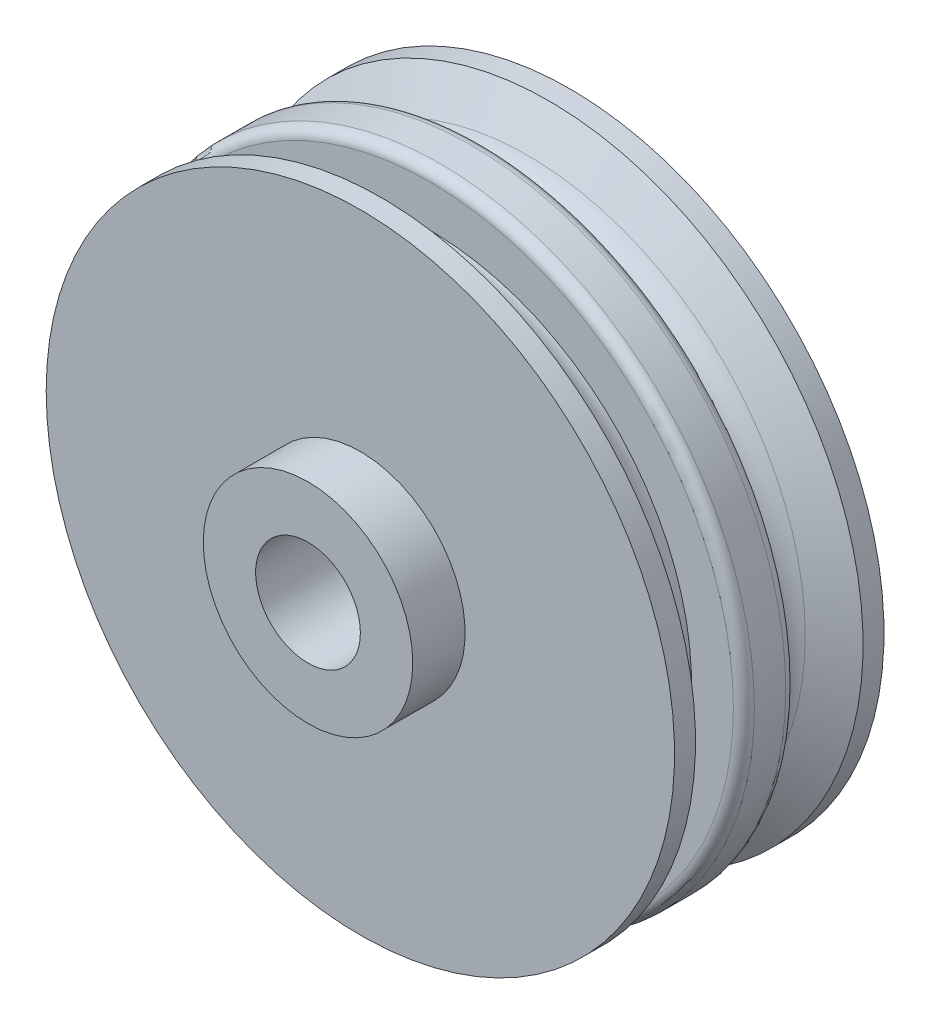
ISO-10303-21;
HEADER;
FILE_DESCRIPTION(('STEP AP214'),'2;1');
FILE_NAME('part.step','',(''),(''),'','','');
FILE_SCHEMA(('AUTOMOTIVE_DESIGN { 1 0 10303 214 1 1 1 1 }'));
ENDSEC;
DATA;
#1=APPLICATION_CONTEXT('core data for automotive mechanical design processes');
#2=APPLICATION_PROTOCOL_DEFINITION('international standard','automotive_design',2000,#1);
#3=PRODUCT_CONTEXT('',#1,'mechanical');
#4=PRODUCT('Part','Part','',(#3));
#5=PRODUCT_RELATED_PRODUCT_CATEGORY('part','',(#4));
#6=PRODUCT_DEFINITION_FORMATION('','',#4);
#7=PRODUCT_DEFINITION_CONTEXT('part definition',#1,'design');
#8=PRODUCT_DEFINITION('design','',#6,#7);
#9=PRODUCT_DEFINITION_SHAPE('','',#8);
#10=(LENGTH_UNIT() NAMED_UNIT(*) SI_UNIT(.MILLI.,.METRE.));
#11=(NAMED_UNIT(*) PLANE_ANGLE_UNIT() SI_UNIT($,.RADIAN.));
#12=(NAMED_UNIT(*) SI_UNIT($,.STERADIAN.) SOLID_ANGLE_UNIT());
#13=UNCERTAINTY_MEASURE_WITH_UNIT(LENGTH_MEASURE(1.E-05),#10,'distance_accuracy_value','');
#14=(GEOMETRIC_REPRESENTATION_CONTEXT(3) GLOBAL_UNCERTAINTY_ASSIGNED_CONTEXT((#13)) GLOBAL_UNIT_ASSIGNED_CONTEXT((#10,
#11,#12)) REPRESENTATION_CONTEXT('',''));
#15=CARTESIAN_POINT('',(0.,0.,0.));
#16=DIRECTION('',(0.,0.,1.));
#17=DIRECTION('',(1.,0.,0.));
#18=AXIS2_PLACEMENT_3D('',#15,#16,#17);
#19=CARTESIAN_POINT('',(0.,0.,0.));
#20=DIRECTION('',(0.,0.,-1.));
#21=DIRECTION('',(-1.,0.,0.));
#22=AXIS2_PLACEMENT_3D('',#19,#20,#21);
#23=CYLINDRICAL_SURFACE('',#22,25.);
#24=CARTESIAN_POINT('',(0.,0.,11.618802153517));
#25=DIRECTION('',(0.,0.,-1.));
#26=DIRECTION('',(-1.,0.,0.));
#27=AXIS2_PLACEMENT_3D('',#24,#25,#26);
#28=CIRCLE('',#27,25.);
#29=CARTESIAN_POINT('',(-25.,0.,11.618802153517));
#30=VERTEX_POINT('',#29);
#31=EDGE_CURVE('E81',#30,#30,#28,.F.);
#32=ORIENTED_EDGE('',*,*,#31,.T.);
#33=EDGE_LOOP('',(#32));
#34=FACE_BOUND('',#33,.T.);
#35=CARTESIAN_POINT('',(0.,0.,13.381197846483));
#36=DIRECTION('',(0.,0.,1.));
#37=DIRECTION('',(1.,0.,0.));
#38=AXIS2_PLACEMENT_3D('',#35,#36,#37);
#39=CIRCLE('',#38,25.);
#40=CARTESIAN_POINT('',(25.,0.,13.381197846483));
#41=VERTEX_POINT('',#40);
#42=EDGE_CURVE('E125',#41,#41,#39,.T.);
#43=ORIENTED_EDGE('',*,*,#42,.F.);
#44=EDGE_LOOP('',(#43));
#45=FACE_BOUND('',#44,.T.);
#46=ADVANCED_FACE('F45',(#34,#45),#23,.T.);
#47=CARTESIAN_POINT('',(0.,0.,30.));
#48=DIRECTION('',(0.,0.,-1.));
#49=DIRECTION('',(-1.,0.,0.));
#50=AXIS2_PLACEMENT_3D('',#47,#48,#49);
#51=CYLINDRICAL_SURFACE('',#50,10.);
#52=CARTESIAN_POINT('',(0.,0.,30.));
#53=DIRECTION('',(0.,0.,1.));
#54=DIRECTION('',(1.,0.,0.));
#55=AXIS2_PLACEMENT_3D('',#52,#53,#54);
#56=CIRCLE('',#55,10.);
#57=CARTESIAN_POINT('',(10.,0.,30.));
#58=VERTEX_POINT('',#57);
#59=EDGE_CURVE('E89',#58,#58,#56,.T.);
#60=ORIENTED_EDGE('',*,*,#59,.F.);
#61=EDGE_LOOP('',(#60));
#62=FACE_BOUND('',#61,.T.);
#63=CARTESIAN_POINT('',(0.,0.,25.));
#64=DIRECTION('',(0.,0.,-1.));
#65=DIRECTION('',(-1.,0.,0.));
#66=AXIS2_PLACEMENT_3D('',#63,#64,#65);
#67=CIRCLE('',#66,10.);
#68=CARTESIAN_POINT('',(-10.,0.,25.));
#69=VERTEX_POINT('',#68);
#70=EDGE_CURVE('E85',#69,#69,#67,.T.);
#71=ORIENTED_EDGE('',*,*,#70,.F.);
#72=EDGE_LOOP('',(#71));
#73=FACE_BOUND('',#72,.T.);
#74=ADVANCED_FACE('F133',(#62,#73),#51,.T.);
#75=CARTESIAN_POINT('',(0.,0.,30.));
#76=DIRECTION('',(0.,0.,1.));
#77=DIRECTION('',(1.,0.,0.));
#78=AXIS2_PLACEMENT_3D('',#75,#76,#77);
#79=PLANE('',#78);
#80=ORIENTED_EDGE('',*,*,#59,.T.);
#81=EDGE_LOOP('',(#80));
#82=FACE_BOUND('',#81,.T.);
#83=CARTESIAN_POINT('',(0.,0.,30.));
#84=DIRECTION('',(0.,0.,1.));
#85=DIRECTION('',(1.,0.,0.));
#86=AXIS2_PLACEMENT_3D('',#83,#84,#85);
#87=CIRCLE('',#86,5.);
#88=CARTESIAN_POINT('',(5.,0.,30.));
#89=VERTEX_POINT('',#88);
#90=EDGE_CURVE('E94',#89,#89,#87,.T.);
#91=ORIENTED_EDGE('',*,*,#90,.F.);
#92=EDGE_LOOP('',(#91));
#93=FACE_BOUND('',#92,.T.);
#94=ADVANCED_FACE('F139',(#82,#93),#79,.T.);
#95=CARTESIAN_POINT('',(0.,0.,0.));
#96=DIRECTION('',(0.,0.,1.));
#97=DIRECTION('',(1.,0.,0.));
#98=AXIS2_PLACEMENT_3D('',#95,#96,#97);
#99=PLANE('',#98);
#100=CARTESIAN_POINT('',(0.,0.,0.));
#101=DIRECTION('',(0.,0.,1.));
#102=DIRECTION('',(1.,0.,0.));
#103=AXIS2_PLACEMENT_3D('',#100,#101,#102);
#104=CIRCLE('',#103,10.);
#105=CARTESIAN_POINT('',(10.,0.,0.));
#106=VERTEX_POINT('',#105);
#107=EDGE_CURVE('E90',#106,#106,#104,.T.);
#108=ORIENTED_EDGE('',*,*,#107,.F.);
#109=EDGE_LOOP('',(#108));
#110=FACE_BOUND('',#109,.T.);
#111=CARTESIAN_POINT('',(0.,0.,0.));
#112=DIRECTION('',(0.,0.,1.));
#113=DIRECTION('',(1.,0.,0.));
#114=AXIS2_PLACEMENT_3D('',#111,#112,#113);
#115=CIRCLE('',#114,5.);
#116=CARTESIAN_POINT('',(5.,0.,0.));
#117=VERTEX_POINT('',#116);
#118=EDGE_CURVE('E98',#117,#117,#115,.T.);
#119=ORIENTED_EDGE('',*,*,#118,.T.);
#120=EDGE_LOOP('',(#119));
#121=FACE_BOUND('',#120,.T.);
#122=ADVANCED_FACE('F161',(#110,#121),#99,.F.);
#123=CARTESIAN_POINT('',(0.,0.,5.));
#124=DIRECTION('',(0.,0.,-1.));
#125=DIRECTION('',(-1.,0.,0.));
#126=AXIS2_PLACEMENT_3D('',#123,#124,#125);
#127=CIRCLE('',#126,10.);
#128=CARTESIAN_POINT('',(-10.,0.,5.));
#129=VERTEX_POINT('',#128);
#130=EDGE_CURVE('E117',#129,#129,#127,.T.);
#131=ORIENTED_EDGE('',*,*,#130,.T.);
#132=EDGE_LOOP('',(#131));
#133=FACE_BOUND('',#132,.T.);
#134=ORIENTED_EDGE('',*,*,#107,.T.);
#135=EDGE_LOOP('',(#134));
#136=FACE_BOUND('',#135,.T.);
#137=ADVANCED_FACE('F142',(#133,#136),#51,.T.);
#138=CARTESIAN_POINT('',(0.,0.,30.));
#139=DIRECTION('',(0.,0.,-1.));
#140=DIRECTION('',(-1.,0.,0.));
#141=AXIS2_PLACEMENT_3D('',#138,#139,#140);
#142=CYLINDRICAL_SURFACE('',#141,5.);
#143=ORIENTED_EDGE('',*,*,#90,.T.);
#144=EDGE_LOOP('',(#143));
#145=FACE_BOUND('',#144,.T.);
#146=ORIENTED_EDGE('',*,*,#118,.F.);
#147=EDGE_LOOP('',(#146));
#148=FACE_BOUND('',#147,.T.);
#149=ADVANCED_FACE('F154',(#145,#148),#142,.F.);
#150=CARTESIAN_POINT('',(0.,0.,0.));
#151=DIRECTION('',(0.,0.,-1.));
#152=DIRECTION('',(-1.,0.,0.));
#153=AXIS2_PLACEMENT_3D('',#150,#151,#152);
#154=CYLINDRICAL_SURFACE('',#153,30.);
#155=CARTESIAN_POINT('',(0.,0.,23.));
#156=DIRECTION('',(0.,0.,-1.));
#157=DIRECTION('',(-1.,0.,0.));
#158=AXIS2_PLACEMENT_3D('',#155,#156,#157);
#159=CIRCLE('',#158,30.);
#160=CARTESIAN_POINT('',(-30.,0.,23.));
#161=VERTEX_POINT('',#160);
#162=EDGE_CURVE('E102',#161,#161,#159,.T.);
#163=ORIENTED_EDGE('',*,*,#162,.F.);
#164=EDGE_LOOP('',(#163));
#165=FACE_BOUND('',#164,.T.);
#166=CARTESIAN_POINT('',(0.,0.,25.));
#167=DIRECTION('',(0.,0.,-1.));
#168=DIRECTION('',(-1.,0.,0.));
#169=AXIS2_PLACEMENT_3D('',#166,#167,#168);
#170=CIRCLE('',#169,30.);
#171=CARTESIAN_POINT('',(-30.,0.,25.));
#172=VERTEX_POINT('',#171);
#173=EDGE_CURVE('E121',#172,#172,#170,.T.);
#174=ORIENTED_EDGE('',*,*,#173,.T.);
#175=EDGE_LOOP('',(#174));
#176=FACE_BOUND('',#175,.T.);
#177=ADVANCED_FACE('F150',(#165,#176),#154,.T.);
#178=CARTESIAN_POINT('',(0.,0.,23.));
#179=DIRECTION('',(0.,0.,1.));
#180=DIRECTION('',(1.,0.,0.));
#181=AXIS2_PLACEMENT_3D('',#178,#179,#180);
#182=CONICAL_SURFACE('',#181,30.,1.0471975511966);
#183=CARTESIAN_POINT('',(0.,0.,20.9792740578363));
#184=DIRECTION('',(0.,0.,-1.));
#185=DIRECTION('',(-1.,0.,0.));
#186=AXIS2_PLACEMENT_3D('',#183,#184,#185);
#187=CIRCLE('',#186,26.5);
#188=CARTESIAN_POINT('',(-26.5,0.,20.9792740578363));
#189=VERTEX_POINT('',#188);
#190=EDGE_CURVE('E73',#189,#189,#187,.F.);
#191=ORIENTED_EDGE('',*,*,#190,.T.);
#192=EDGE_LOOP('',(#191));
#193=FACE_BOUND('',#192,.T.);
#194=ORIENTED_EDGE('',*,*,#162,.T.);
#195=EDGE_LOOP('',(#194));
#196=FACE_BOUND('',#195,.T.);
#197=ADVANCED_FACE('F147',(#193,#196),#182,.T.);
#198=CARTESIAN_POINT('',(0.,0.,7.));
#199=DIRECTION('',(0.,0.,-1.));
#200=DIRECTION('',(-1.,0.,0.));
#201=AXIS2_PLACEMENT_3D('',#198,#199,#200);
#202=CONICAL_SURFACE('',#201,30.,1.0471975511966);
#203=CARTESIAN_POINT('',(0.,0.,9.02072594216368));
#204=DIRECTION('',(0.,0.,-1.));
#205=DIRECTION('',(-1.,0.,0.));
#206=AXIS2_PLACEMENT_3D('',#203,#204,#205);
#207=CIRCLE('',#206,26.5);
#208=CARTESIAN_POINT('',(-26.5,0.,9.02072594216368));
#209=VERTEX_POINT('',#208);
#210=EDGE_CURVE('E69',#209,#209,#207,.T.);
#211=ORIENTED_EDGE('',*,*,#210,.T.);
#212=EDGE_LOOP('',(#211));
#213=FACE_BOUND('',#212,.T.);
#214=CARTESIAN_POINT('',(0.,0.,7.));
#215=DIRECTION('',(0.,0.,-1.));
#216=DIRECTION('',(-1.,0.,0.));
#217=AXIS2_PLACEMENT_3D('',#214,#215,#216);
#218=CIRCLE('',#217,30.);
#219=CARTESIAN_POINT('',(-30.,0.,7.));
#220=VERTEX_POINT('',#219);
#221=EDGE_CURVE('E109',#220,#220,#218,.T.);
#222=ORIENTED_EDGE('',*,*,#221,.F.);
#223=EDGE_LOOP('',(#222));
#224=FACE_BOUND('',#223,.T.);
#225=ADVANCED_FACE('F145',(#213,#224),#202,.T.);
#226=CARTESIAN_POINT('',(0.,0.,0.));
#227=DIRECTION('',(0.,0.,-1.));
#228=DIRECTION('',(-1.,0.,0.));
#229=AXIS2_PLACEMENT_3D('',#226,#227,#228);
#230=CYLINDRICAL_SURFACE('',#229,30.);
#231=ORIENTED_EDGE('',*,*,#221,.T.);
#232=EDGE_LOOP('',(#231));
#233=FACE_BOUND('',#232,.T.);
#234=CARTESIAN_POINT('',(0.,0.,5.));
#235=DIRECTION('',(0.,0.,-1.));
#236=DIRECTION('',(-1.,0.,0.));
#237=AXIS2_PLACEMENT_3D('',#234,#235,#236);
#238=CIRCLE('',#237,30.);
#239=CARTESIAN_POINT('',(-30.,0.,5.));
#240=VERTEX_POINT('',#239);
#241=EDGE_CURVE('E113',#240,#240,#238,.T.);
#242=ORIENTED_EDGE('',*,*,#241,.F.);
#243=EDGE_LOOP('',(#242));
#244=FACE_BOUND('',#243,.T.);
#245=ADVANCED_FACE('F205',(#233,#244),#230,.T.);
#246=CARTESIAN_POINT('',(0.,0.,5.));
#247=DIRECTION('',(0.,0.,-1.));
#248=DIRECTION('',(-1.,0.,0.));
#249=AXIS2_PLACEMENT_3D('',#246,#247,#248);
#250=PLANE('',#249);
#251=ORIENTED_EDGE('',*,*,#241,.T.);
#252=EDGE_LOOP('',(#251));
#253=FACE_BOUND('',#252,.T.);
#254=ORIENTED_EDGE('',*,*,#130,.F.);
#255=EDGE_LOOP('',(#254));
#256=FACE_BOUND('',#255,.T.);
#257=ADVANCED_FACE('F202',(#253,#256),#250,.T.);
#258=CARTESIAN_POINT('',(0.,0.,25.));
#259=DIRECTION('',(0.,0.,-1.));
#260=DIRECTION('',(-1.,0.,0.));
#261=AXIS2_PLACEMENT_3D('',#258,#259,#260);
#262=PLANE('',#261);
#263=ORIENTED_EDGE('',*,*,#173,.F.);
#264=EDGE_LOOP('',(#263));
#265=FACE_BOUND('',#264,.T.);
#266=ORIENTED_EDGE('',*,*,#70,.T.);
#267=EDGE_LOOP('',(#266));
#268=FACE_BOUND('',#267,.T.);
#269=ADVANCED_FACE('F172',(#265,#268),#262,.F.);
#270=CARTESIAN_POINT('',(0.,0.,18.381197846483));
#271=DIRECTION('',(0.,0.,-1.));
#272=DIRECTION('',(-1.,0.,0.));
#273=AXIS2_PLACEMENT_3D('',#270,#271,#272);
#274=TOROIDAL_SURFACE('',#273,28.,3.);
#275=ORIENTED_EDGE('',*,*,#190,.F.);
#276=EDGE_LOOP('',(#275));
#277=FACE_BOUND('',#276,.T.);
#278=CARTESIAN_POINT('',(0.,0.,18.381197846483));
#279=DIRECTION('',(0.,0.,-1.));
#280=DIRECTION('',(-1.,0.,0.));
#281=AXIS2_PLACEMENT_3D('',#278,#279,#280);
#282=CIRCLE('',#281,25.);
#283=CARTESIAN_POINT('',(-25.,0.,18.381197846483));
#284=VERTEX_POINT('',#283);
#285=EDGE_CURVE('E77',#284,#284,#282,.T.);
#286=ORIENTED_EDGE('',*,*,#285,.F.);
#287=EDGE_LOOP('',(#286));
#288=FACE_BOUND('',#287,.T.);
#289=ADVANCED_FACE('F168',(#277,#288),#274,.F.);
#290=CARTESIAN_POINT('',(0.,0.,11.618802153517));
#291=DIRECTION('',(0.,0.,-1.));
#292=DIRECTION('',(-1.,0.,0.));
#293=AXIS2_PLACEMENT_3D('',#290,#291,#292);
#294=TOROIDAL_SURFACE('',#293,28.,3.);
#295=ORIENTED_EDGE('',*,*,#31,.F.);
#296=EDGE_LOOP('',(#295));
#297=FACE_BOUND('',#296,.T.);
#298=ORIENTED_EDGE('',*,*,#210,.F.);
#299=EDGE_LOOP('',(#298));
#300=FACE_BOUND('',#299,.T.);
#301=ADVANCED_FACE('F171',(#297,#300),#294,.F.);
#302=CARTESIAN_POINT('',(0.,0.,13.381197846483));
#303=DIRECTION('',(0.,0.,1.));
#304=DIRECTION('',(1.,0.,0.));
#305=AXIS2_PLACEMENT_3D('',#302,#303,#304);
#306=CYLINDRICAL_SURFACE('',#305,30.);
#307=CARTESIAN_POINT('',(0.,0.,17.381197846483));
#308=DIRECTION('',(0.,0.,1.));
#309=DIRECTION('',(1.,0.,0.));
#310=AXIS2_PLACEMENT_3D('',#307,#308,#309);
#311=CIRCLE('',#310,30.);
#312=CARTESIAN_POINT('',(30.,0.,17.381197846483));
#313=VERTEX_POINT('',#312);
#314=EDGE_CURVE('E53',#313,#313,#311,.F.);
#315=ORIENTED_EDGE('',*,*,#314,.T.);
#316=EDGE_LOOP('',(#315));
#317=FACE_BOUND('',#316,.T.);
#318=CARTESIAN_POINT('',(0.,0.,14.381197846483));
#319=DIRECTION('',(0.,0.,1.));
#320=DIRECTION('',(1.,0.,0.));
#321=AXIS2_PLACEMENT_3D('',#318,#319,#320);
#322=CIRCLE('',#321,30.);
#323=CARTESIAN_POINT('',(30.,0.,14.381197846483));
#324=VERTEX_POINT('',#323);
#325=EDGE_CURVE('E58',#324,#324,#322,.T.);
#326=ORIENTED_EDGE('',*,*,#325,.T.);
#327=EDGE_LOOP('',(#326));
#328=FACE_BOUND('',#327,.T.);
#329=ADVANCED_FACE('F175',(#317,#328),#306,.T.);
#330=CARTESIAN_POINT('',(0.,0.,13.381197846483));
#331=DIRECTION('',(0.,0.,1.));
#332=DIRECTION('',(1.,0.,0.));
#333=AXIS2_PLACEMENT_3D('',#330,#331,#332);
#334=PLANE('',#333);
#335=CARTESIAN_POINT('',(0.,0.,13.381197846483));
#336=DIRECTION('',(0.,0.,1.));
#337=DIRECTION('',(1.,0.,0.));
#338=AXIS2_PLACEMENT_3D('',#335,#336,#337);
#339=CIRCLE('',#338,29.);
#340=CARTESIAN_POINT('',(29.,0.,13.381197846483));
#341=VERTEX_POINT('',#340);
#342=EDGE_CURVE('E10',#341,#341,#339,.F.);
#343=ORIENTED_EDGE('',*,*,#342,.T.);
#344=EDGE_LOOP('',(#343));
#345=FACE_BOUND('',#344,.T.);
#346=ORIENTED_EDGE('',*,*,#42,.T.);
#347=EDGE_LOOP('',(#346));
#348=FACE_BOUND('',#347,.T.);
#349=ADVANCED_FACE('F130',(#345,#348),#334,.F.);
#350=CARTESIAN_POINT('',(0.,0.,18.381197846483));
#351=DIRECTION('',(0.,0.,1.));
#352=DIRECTION('',(1.,0.,0.));
#353=AXIS2_PLACEMENT_3D('',#350,#351,#352);
#354=PLANE('',#353);
#355=CARTESIAN_POINT('',(0.,0.,18.381197846483));
#356=DIRECTION('',(0.,0.,1.));
#357=DIRECTION('',(1.,0.,0.));
#358=AXIS2_PLACEMENT_3D('',#355,#356,#357);
#359=CIRCLE('',#358,29.);
#360=CARTESIAN_POINT('',(29.,0.,18.381197846483));
#361=VERTEX_POINT('',#360);
#362=EDGE_CURVE('E63',#361,#361,#359,.T.);
#363=ORIENTED_EDGE('',*,*,#362,.T.);
#364=EDGE_LOOP('',(#363));
#365=FACE_BOUND('',#364,.T.);
#366=ORIENTED_EDGE('',*,*,#285,.T.);
#367=EDGE_LOOP('',(#366));
#368=FACE_BOUND('',#367,.T.);
#369=ADVANCED_FACE('F179',(#365,#368),#354,.T.);
#370=CARTESIAN_POINT('',(0.,0.,17.381197846483));
#371=DIRECTION('',(0.,0.,1.));
#372=DIRECTION('',(1.,0.,0.));
#373=AXIS2_PLACEMENT_3D('',#370,#371,#372);
#374=TOROIDAL_SURFACE('',#373,29.,1.);
#375=ORIENTED_EDGE('',*,*,#314,.F.);
#376=EDGE_LOOP('',(#375));
#377=FACE_BOUND('',#376,.T.);
#378=ORIENTED_EDGE('',*,*,#362,.F.);
#379=EDGE_LOOP('',(#378));
#380=FACE_BOUND('',#379,.T.);
#381=ADVANCED_FACE('F177',(#377,#380),#374,.T.);
#382=CARTESIAN_POINT('',(0.,0.,14.381197846483));
#383=DIRECTION('',(0.,0.,1.));
#384=DIRECTION('',(1.,0.,0.));
#385=AXIS2_PLACEMENT_3D('',#382,#383,#384);
#386=TOROIDAL_SURFACE('',#385,29.,1.);
#387=ORIENTED_EDGE('',*,*,#342,.F.);
#388=EDGE_LOOP('',(#387));
#389=FACE_BOUND('',#388,.T.);
#390=ORIENTED_EDGE('',*,*,#325,.F.);
#391=EDGE_LOOP('',(#390));
#392=FACE_BOUND('',#391,.T.);
#393=ADVANCED_FACE('F47',(#389,#392),#386,.T.);
#394=CLOSED_SHELL('',(#46,#74,#94,#122,#137,#149,#177,#197,#225,#245,#257,#269,#289,#301,#329,
#349,#369,#381,#393));
#395=MANIFOLD_SOLID_BREP('B2',#394);
#396=ADVANCED_BREP_SHAPE_REPRESENTATION('',(#18,#395),#14);
#397=SHAPE_DEFINITION_REPRESENTATION(#9,#396);
ENDSEC;
END-ISO-10303-21;
